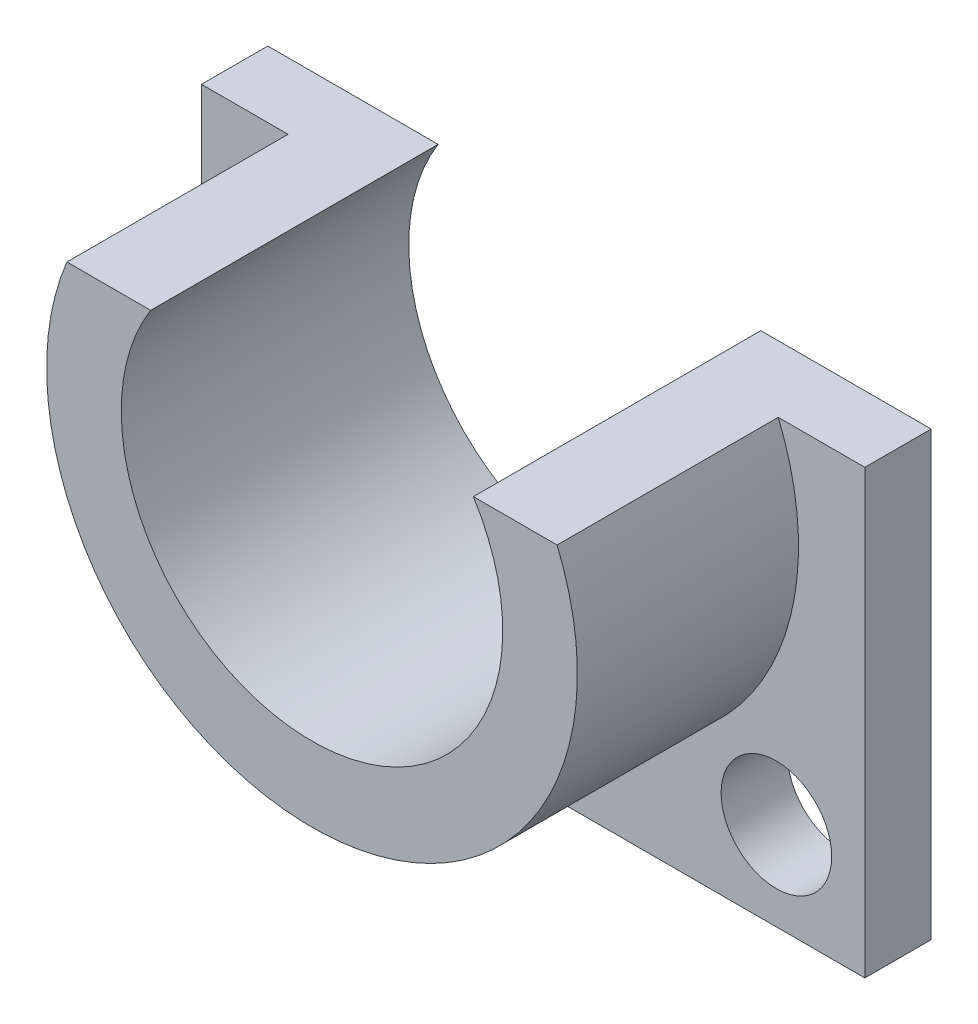
ISO-10303-21;
HEADER;
FILE_DESCRIPTION(('STEP AP214'),'2;1');
FILE_NAME('part.step','',(''),(''),'','','');
FILE_SCHEMA(('AUTOMOTIVE_DESIGN { 1 0 10303 214 1 1 1 1 }'));
ENDSEC;
DATA;
#1=APPLICATION_CONTEXT('core data for automotive mechanical design processes');
#2=APPLICATION_PROTOCOL_DEFINITION('international standard','automotive_design',2000,#1);
#3=PRODUCT_CONTEXT('',#1,'mechanical');
#4=PRODUCT('Part','Part','',(#3));
#5=PRODUCT_RELATED_PRODUCT_CATEGORY('part','',(#4));
#6=PRODUCT_DEFINITION_FORMATION('','',#4);
#7=PRODUCT_DEFINITION_CONTEXT('part definition',#1,'design');
#8=PRODUCT_DEFINITION('design','',#6,#7);
#9=PRODUCT_DEFINITION_SHAPE('','',#8);
#10=(LENGTH_UNIT() NAMED_UNIT(*) SI_UNIT(.MILLI.,.METRE.));
#11=(NAMED_UNIT(*) PLANE_ANGLE_UNIT() SI_UNIT($,.RADIAN.));
#12=(NAMED_UNIT(*) SI_UNIT($,.STERADIAN.) SOLID_ANGLE_UNIT());
#13=UNCERTAINTY_MEASURE_WITH_UNIT(LENGTH_MEASURE(1.E-05),#10,'distance_accuracy_value','');
#14=(GEOMETRIC_REPRESENTATION_CONTEXT(3) GLOBAL_UNCERTAINTY_ASSIGNED_CONTEXT((#13)) GLOBAL_UNIT_ASSIGNED_CONTEXT((#10,
#11,#12)) REPRESENTATION_CONTEXT('',''));
#15=CARTESIAN_POINT('',(0.,0.,0.));
#16=DIRECTION('',(0.,0.,1.));
#17=DIRECTION('',(1.,0.,0.));
#18=AXIS2_PLACEMENT_3D('',#15,#16,#17);
#19=CARTESIAN_POINT('',(9.26583374891318,57.15,3.81));
#20=DIRECTION('',(0.,-1.,0.));
#21=DIRECTION('',(1.,0.,0.));
#22=AXIS2_PLACEMENT_3D('',#19,#20,#21);
#23=PLANE('',#22);
#24=DIRECTION('',(-1.,0.,0.));
#25=VECTOR('',#24,1.);
#26=CARTESIAN_POINT('',(9.26583374891318,57.15,0.));
#27=LINE('',#26,#25);
#28=CARTESIAN_POINT('',(19.05,57.15,0.));
#29=VERTEX_POINT('',#28);
#30=CARTESIAN_POINT('',(9.26583374891324,57.15,0.));
#31=VERTEX_POINT('',#30);
#32=EDGE_CURVE('E145',#29,#31,#27,.T.);
#33=ORIENTED_EDGE('',*,*,#32,.T.);
#34=DIRECTION('',(0.,0.,-1.));
#35=VECTOR('',#34,1.);
#36=CARTESIAN_POINT('',(9.26583374891324,57.15,3.81));
#37=LINE('',#36,#35);
#38=CARTESIAN_POINT('',(9.26583374891324,57.15,16.51));
#39=VERTEX_POINT('',#38);
#40=EDGE_CURVE('E11',#39,#31,#37,.T.);
#41=ORIENTED_EDGE('',*,*,#40,.F.);
#42=DIRECTION('',(-1.,0.,0.));
#43=VECTOR('',#42,1.);
#44=CARTESIAN_POINT('',(14.0758174185373,57.15,16.51));
#45=LINE('',#44,#43);
#46=CARTESIAN_POINT('',(14.0758174185373,57.15,16.51));
#47=VERTEX_POINT('',#46);
#48=EDGE_CURVE('E131',#47,#39,#45,.T.);
#49=ORIENTED_EDGE('',*,*,#48,.F.);
#50=DIRECTION('',(0.,0.,-1.));
#51=VECTOR('',#50,1.);
#52=CARTESIAN_POINT('',(14.0758174185373,57.15,16.51));
#53=LINE('',#52,#51);
#54=CARTESIAN_POINT('',(14.0758174185373,57.15,3.81));
#55=VERTEX_POINT('',#54);
#56=EDGE_CURVE('E140',#47,#55,#53,.T.);
#57=ORIENTED_EDGE('',*,*,#56,.T.);
#58=DIRECTION('',(-1.,0.,0.));
#59=VECTOR('',#58,1.);
#60=CARTESIAN_POINT('',(9.26583374891318,57.15,3.81));
#61=LINE('',#60,#59);
#62=CARTESIAN_POINT('',(19.05,57.15,3.81));
#63=VERTEX_POINT('',#62);
#64=EDGE_CURVE('E146',#63,#55,#61,.T.);
#65=ORIENTED_EDGE('',*,*,#64,.F.);
#66=DIRECTION('',(0.,0.,-1.));
#67=VECTOR('',#66,1.);
#68=CARTESIAN_POINT('',(19.05,57.15,3.81));
#69=LINE('',#68,#67);
#70=EDGE_CURVE('E154',#63,#29,#69,.T.);
#71=ORIENTED_EDGE('',*,*,#70,.T.);
#72=EDGE_LOOP('',(#33,#41,#49,#57,#65,#71));
#73=FACE_BOUND('',#72,.T.);
#74=ADVANCED_FACE('F41',(#73),#23,.F.);
#75=CARTESIAN_POINT('',(0.,51.308,3.81));
#76=DIRECTION('',(0.,0.,-1.));
#77=DIRECTION('',(-1.,0.,0.));
#78=AXIS2_PLACEMENT_3D('',#75,#76,#77);
#79=CYLINDRICAL_SURFACE('',#78,10.9537499999999);
#80=CARTESIAN_POINT('',(0.,51.308,0.));
#81=DIRECTION('',(0.,0.,-1.));
#82=DIRECTION('',(1.,0.,0.));
#83=AXIS2_PLACEMENT_3D('',#80,#81,#82);
#84=CIRCLE('',#83,10.9537499999999);
#85=CARTESIAN_POINT('',(-9.26583374891318,57.15,0.));
#86=VERTEX_POINT('',#85);
#87=EDGE_CURVE('E115',#31,#86,#84,.T.);
#88=ORIENTED_EDGE('',*,*,#87,.T.);
#89=DIRECTION('',(0.,0.,-1.));
#90=VECTOR('',#89,1.);
#91=CARTESIAN_POINT('',(-9.26583374891318,57.15,3.81));
#92=LINE('',#91,#90);
#93=CARTESIAN_POINT('',(-9.26583374891314,57.15,16.51));
#94=VERTEX_POINT('',#93);
#95=EDGE_CURVE('E48',#94,#86,#92,.T.);
#96=ORIENTED_EDGE('',*,*,#95,.F.);
#97=CARTESIAN_POINT('',(0.,51.308,16.51));
#98=DIRECTION('',(0.,0.,-1.));
#99=DIRECTION('',(1.,0.,0.));
#100=AXIS2_PLACEMENT_3D('',#97,#98,#99);
#101=CIRCLE('',#100,10.9537499999999);
#102=EDGE_CURVE('E114',#39,#94,#101,.T.);
#103=ORIENTED_EDGE('',*,*,#102,.F.);
#104=ORIENTED_EDGE('',*,*,#40,.T.);
#105=EDGE_LOOP('',(#88,#96,#103,#104));
#106=FACE_BOUND('',#105,.T.);
#107=ADVANCED_FACE('F112',(#106),#79,.F.);
#108=CARTESIAN_POINT('',(-19.05,57.15,3.81));
#109=DIRECTION('',(0.,-1.,0.));
#110=DIRECTION('',(1.,0.,0.));
#111=AXIS2_PLACEMENT_3D('',#108,#109,#110);
#112=PLANE('',#111);
#113=DIRECTION('',(-1.,0.,0.));
#114=VECTOR('',#113,1.);
#115=CARTESIAN_POINT('',(-19.05,57.15,0.));
#116=LINE('',#115,#114);
#117=CARTESIAN_POINT('',(-19.05,57.15,0.));
#118=VERTEX_POINT('',#117);
#119=EDGE_CURVE('E158',#86,#118,#116,.T.);
#120=ORIENTED_EDGE('',*,*,#119,.T.);
#121=DIRECTION('',(0.,0.,-1.));
#122=VECTOR('',#121,1.);
#123=CARTESIAN_POINT('',(-19.05,57.15,3.81));
#124=LINE('',#123,#122);
#125=CARTESIAN_POINT('',(-19.05,57.15,3.81));
#126=VERTEX_POINT('',#125);
#127=EDGE_CURVE('E118',#126,#118,#124,.T.);
#128=ORIENTED_EDGE('',*,*,#127,.F.);
#129=DIRECTION('',(-1.,0.,0.));
#130=VECTOR('',#129,1.);
#131=CARTESIAN_POINT('',(-19.05,57.15,3.81));
#132=LINE('',#131,#130);
#133=CARTESIAN_POINT('',(-14.0758174185372,57.15,3.81));
#134=VERTEX_POINT('',#133);
#135=EDGE_CURVE('E93',#134,#126,#132,.T.);
#136=ORIENTED_EDGE('',*,*,#135,.F.);
#137=DIRECTION('',(0.,0.,-1.));
#138=VECTOR('',#137,1.);
#139=CARTESIAN_POINT('',(-14.0758174185372,57.1499999999999,16.51));
#140=LINE('',#139,#138);
#141=CARTESIAN_POINT('',(-14.0758174185372,57.1499999999999,16.51));
#142=VERTEX_POINT('',#141);
#143=EDGE_CURVE('E123',#142,#134,#140,.T.);
#144=ORIENTED_EDGE('',*,*,#143,.F.);
#145=DIRECTION('',(-1.,0.,0.));
#146=VECTOR('',#145,1.);
#147=CARTESIAN_POINT('',(-9.26583374891314,57.15,16.51));
#148=LINE('',#147,#146);
#149=EDGE_CURVE('E120',#94,#142,#148,.T.);
#150=ORIENTED_EDGE('',*,*,#149,.F.);
#151=ORIENTED_EDGE('',*,*,#95,.T.);
#152=EDGE_LOOP('',(#120,#128,#136,#144,#150,#151));
#153=FACE_BOUND('',#152,.T.);
#154=ADVANCED_FACE('F121',(#153),#112,.F.);
#155=CARTESIAN_POINT('',(-19.05,31.75,3.81));
#156=DIRECTION('',(1.,0.,0.));
#157=DIRECTION('',(0.,1.,0.));
#158=AXIS2_PLACEMENT_3D('',#155,#156,#157);
#159=PLANE('',#158);
#160=DIRECTION('',(0.,-1.,0.));
#161=VECTOR('',#160,1.);
#162=CARTESIAN_POINT('',(-19.05,31.75,0.));
#163=LINE('',#162,#161);
#164=CARTESIAN_POINT('',(-19.05,31.75,0.));
#165=VERTEX_POINT('',#164);
#166=EDGE_CURVE('E160',#118,#165,#163,.T.);
#167=ORIENTED_EDGE('',*,*,#166,.T.);
#168=DIRECTION('',(0.,0.,-1.));
#169=VECTOR('',#168,1.);
#170=CARTESIAN_POINT('',(-19.05,31.75,3.81));
#171=LINE('',#170,#169);
#172=CARTESIAN_POINT('',(-19.05,31.75,3.81));
#173=VERTEX_POINT('',#172);
#174=EDGE_CURVE('E168',#173,#165,#171,.T.);
#175=ORIENTED_EDGE('',*,*,#174,.F.);
#176=DIRECTION('',(0.,-1.,0.));
#177=VECTOR('',#176,1.);
#178=CARTESIAN_POINT('',(-19.05,31.75,3.81));
#179=LINE('',#178,#177);
#180=EDGE_CURVE('E149',#126,#173,#179,.T.);
#181=ORIENTED_EDGE('',*,*,#180,.F.);
#182=ORIENTED_EDGE('',*,*,#127,.T.);
#183=EDGE_LOOP('',(#167,#175,#181,#182));
#184=FACE_BOUND('',#183,.T.);
#185=ADVANCED_FACE('F175',(#184),#159,.F.);
#186=CARTESIAN_POINT('',(19.05,31.75,3.81));
#187=DIRECTION('',(0.,1.,0.));
#188=DIRECTION('',(0.,0.,1.));
#189=AXIS2_PLACEMENT_3D('',#186,#187,#188);
#190=PLANE('',#189);
#191=DIRECTION('',(1.,0.,0.));
#192=VECTOR('',#191,1.);
#193=CARTESIAN_POINT('',(19.05,31.75,0.));
#194=LINE('',#193,#192);
#195=CARTESIAN_POINT('',(19.05,31.75,0.));
#196=VERTEX_POINT('',#195);
#197=EDGE_CURVE('E162',#165,#196,#194,.T.);
#198=ORIENTED_EDGE('',*,*,#197,.T.);
#199=DIRECTION('',(0.,0.,-1.));
#200=VECTOR('',#199,1.);
#201=CARTESIAN_POINT('',(19.05,31.75,3.81));
#202=LINE('',#201,#200);
#203=CARTESIAN_POINT('',(19.05,31.75,3.81));
#204=VERTEX_POINT('',#203);
#205=EDGE_CURVE('E166',#204,#196,#202,.T.);
#206=ORIENTED_EDGE('',*,*,#205,.F.);
#207=DIRECTION('',(1.,0.,0.));
#208=VECTOR('',#207,1.);
#209=CARTESIAN_POINT('',(19.05,31.75,3.81));
#210=LINE('',#209,#208);
#211=EDGE_CURVE('E151',#173,#204,#210,.T.);
#212=ORIENTED_EDGE('',*,*,#211,.F.);
#213=ORIENTED_EDGE('',*,*,#174,.T.);
#214=EDGE_LOOP('',(#198,#206,#212,#213));
#215=FACE_BOUND('',#214,.T.);
#216=ADVANCED_FACE('F183',(#215),#190,.F.);
#217=CARTESIAN_POINT('',(19.05,57.15,3.81));
#218=DIRECTION('',(-1.,0.,0.));
#219=DIRECTION('',(0.,-1.,0.));
#220=AXIS2_PLACEMENT_3D('',#217,#218,#219);
#221=PLANE('',#220);
#222=DIRECTION('',(0.,1.,0.));
#223=VECTOR('',#222,1.);
#224=CARTESIAN_POINT('',(19.05,57.15,0.));
#225=LINE('',#224,#223);
#226=EDGE_CURVE('E89',#196,#29,#225,.T.);
#227=ORIENTED_EDGE('',*,*,#226,.T.);
#228=ORIENTED_EDGE('',*,*,#70,.F.);
#229=DIRECTION('',(0.,1.,0.));
#230=VECTOR('',#229,1.);
#231=CARTESIAN_POINT('',(19.05,57.15,3.81));
#232=LINE('',#231,#230);
#233=EDGE_CURVE('E62',#204,#63,#232,.T.);
#234=ORIENTED_EDGE('',*,*,#233,.F.);
#235=ORIENTED_EDGE('',*,*,#205,.T.);
#236=EDGE_LOOP('',(#227,#228,#234,#235));
#237=FACE_BOUND('',#236,.T.);
#238=ADVANCED_FACE('F185',(#237),#221,.F.);
#239=CARTESIAN_POINT('',(0.,51.308,3.81));
#240=DIRECTION('',(0.,0.,1.));
#241=DIRECTION('',(1.,0.,0.));
#242=AXIS2_PLACEMENT_3D('',#239,#240,#241);
#243=PLANE('',#242);
#244=CARTESIAN_POINT('',(-13.97,36.83,3.81));
#245=DIRECTION('',(0.,0.,1.));
#246=DIRECTION('',(1.,0.,0.));
#247=AXIS2_PLACEMENT_3D('',#244,#245,#246);
#248=CIRCLE('',#247,3.175);
#249=CARTESIAN_POINT('',(-10.795,36.83,3.81));
#250=VERTEX_POINT('',#249);
#251=EDGE_CURVE('E224',#250,#250,#248,.T.);
#252=ORIENTED_EDGE('',*,*,#251,.F.);
#253=EDGE_LOOP('',(#252));
#254=FACE_BOUND('',#253,.T.);
#255=CARTESIAN_POINT('',(13.97,36.83,3.81));
#256=DIRECTION('',(0.,0.,1.));
#257=DIRECTION('',(-1.,0.,0.));
#258=AXIS2_PLACEMENT_3D('',#255,#256,#257);
#259=CIRCLE('',#258,3.175);
#260=CARTESIAN_POINT('',(10.795,36.83,3.81));
#261=VERTEX_POINT('',#260);
#262=EDGE_CURVE('E136',#261,#261,#259,.T.);
#263=ORIENTED_EDGE('',*,*,#262,.F.);
#264=EDGE_LOOP('',(#263));
#265=FACE_BOUND('',#264,.T.);
#266=CARTESIAN_POINT('',(0.,51.308,3.81));
#267=DIRECTION('',(0.,0.,1.));
#268=DIRECTION('',(-1.,0.,0.));
#269=AXIS2_PLACEMENT_3D('',#266,#267,#268);
#270=CIRCLE('',#269,15.2399999999999);
#271=EDGE_CURVE('E55',#134,#55,#270,.T.);
#272=ORIENTED_EDGE('',*,*,#271,.F.);
#273=ORIENTED_EDGE('',*,*,#135,.T.);
#274=ORIENTED_EDGE('',*,*,#180,.T.);
#275=ORIENTED_EDGE('',*,*,#211,.T.);
#276=ORIENTED_EDGE('',*,*,#233,.T.);
#277=ORIENTED_EDGE('',*,*,#64,.T.);
#278=EDGE_LOOP('',(#272,#273,#274,#275,#276,#277));
#279=FACE_BOUND('',#278,.T.);
#280=ADVANCED_FACE('F189',(#254,#265,#279),#243,.T.);
#281=CARTESIAN_POINT('',(0.,51.308,0.));
#282=DIRECTION('',(0.,0.,1.));
#283=DIRECTION('',(1.,0.,0.));
#284=AXIS2_PLACEMENT_3D('',#281,#282,#283);
#285=PLANE('',#284);
#286=CARTESIAN_POINT('',(-13.97,36.83,0.));
#287=DIRECTION('',(0.,0.,1.));
#288=DIRECTION('',(1.,0.,0.));
#289=AXIS2_PLACEMENT_3D('',#286,#287,#288);
#290=CIRCLE('',#289,3.175);
#291=CARTESIAN_POINT('',(-10.795,36.83,0.));
#292=VERTEX_POINT('',#291);
#293=EDGE_CURVE('E133',#292,#292,#290,.F.);
#294=ORIENTED_EDGE('',*,*,#293,.F.);
#295=EDGE_LOOP('',(#294));
#296=FACE_BOUND('',#295,.T.);
#297=CARTESIAN_POINT('',(13.97,36.83,0.));
#298=DIRECTION('',(0.,0.,1.));
#299=DIRECTION('',(1.,0.,0.));
#300=AXIS2_PLACEMENT_3D('',#297,#298,#299);
#301=CIRCLE('',#300,3.175);
#302=CARTESIAN_POINT('',(17.145,36.83,0.));
#303=VERTEX_POINT('',#302);
#304=EDGE_CURVE('E228',#303,#303,#301,.F.);
#305=ORIENTED_EDGE('',*,*,#304,.F.);
#306=EDGE_LOOP('',(#305));
#307=FACE_BOUND('',#306,.T.);
#308=ORIENTED_EDGE('',*,*,#32,.F.);
#309=ORIENTED_EDGE('',*,*,#226,.F.);
#310=ORIENTED_EDGE('',*,*,#197,.F.);
#311=ORIENTED_EDGE('',*,*,#166,.F.);
#312=ORIENTED_EDGE('',*,*,#119,.F.);
#313=ORIENTED_EDGE('',*,*,#87,.F.);
#314=EDGE_LOOP('',(#308,#309,#310,#311,#312,#313));
#315=FACE_BOUND('',#314,.T.);
#316=ADVANCED_FACE('F180',(#296,#307,#315),#285,.F.);
#317=CARTESIAN_POINT('',(0.,51.308,16.51));
#318=DIRECTION('',(0.,0.,-1.));
#319=DIRECTION('',(-1.,0.,0.));
#320=AXIS2_PLACEMENT_3D('',#317,#318,#319);
#321=CYLINDRICAL_SURFACE('',#320,15.2399999999999);
#322=ORIENTED_EDGE('',*,*,#271,.T.);
#323=ORIENTED_EDGE('',*,*,#56,.F.);
#324=CARTESIAN_POINT('',(0.,51.308,16.51));
#325=DIRECTION('',(0.,0.,1.));
#326=DIRECTION('',(-1.,0.,0.));
#327=AXIS2_PLACEMENT_3D('',#324,#325,#326);
#328=CIRCLE('',#327,15.2399999999999);
#329=EDGE_CURVE('E126',#142,#47,#328,.T.);
#330=ORIENTED_EDGE('',*,*,#329,.F.);
#331=ORIENTED_EDGE('',*,*,#143,.T.);
#332=EDGE_LOOP('',(#322,#323,#330,#331));
#333=FACE_BOUND('',#332,.T.);
#334=ADVANCED_FACE('F191',(#333),#321,.T.);
#335=CARTESIAN_POINT('',(0.,51.308,16.51));
#336=DIRECTION('',(0.,0.,1.));
#337=DIRECTION('',(1.,0.,0.));
#338=AXIS2_PLACEMENT_3D('',#335,#336,#337);
#339=PLANE('',#338);
#340=ORIENTED_EDGE('',*,*,#102,.T.);
#341=ORIENTED_EDGE('',*,*,#149,.T.);
#342=ORIENTED_EDGE('',*,*,#329,.T.);
#343=ORIENTED_EDGE('',*,*,#48,.T.);
#344=EDGE_LOOP('',(#340,#341,#342,#343));
#345=FACE_BOUND('',#344,.T.);
#346=ADVANCED_FACE('F129',(#345),#339,.T.);
#347=CARTESIAN_POINT('',(13.97,36.83,-8.98025612106915));
#348=DIRECTION('',(0.,0.,1.));
#349=DIRECTION('',(1.,0.,0.));
#350=AXIS2_PLACEMENT_3D('',#347,#348,#349);
#351=CYLINDRICAL_SURFACE('',#350,3.175);
#352=ORIENTED_EDGE('',*,*,#304,.T.);
#353=EDGE_LOOP('',(#352));
#354=FACE_BOUND('',#353,.T.);
#355=ORIENTED_EDGE('',*,*,#262,.T.);
#356=EDGE_LOOP('',(#355));
#357=FACE_BOUND('',#356,.T.);
#358=ADVANCED_FACE('F198',(#354,#357),#351,.F.);
#359=CARTESIAN_POINT('',(-13.97,36.83,-8.98025612106915));
#360=DIRECTION('',(0.,0.,1.));
#361=DIRECTION('',(1.,0.,0.));
#362=AXIS2_PLACEMENT_3D('',#359,#360,#361);
#363=CYLINDRICAL_SURFACE('',#362,3.175);
#364=ORIENTED_EDGE('',*,*,#293,.T.);
#365=EDGE_LOOP('',(#364));
#366=FACE_BOUND('',#365,.T.);
#367=ORIENTED_EDGE('',*,*,#251,.T.);
#368=EDGE_LOOP('',(#367));
#369=FACE_BOUND('',#368,.T.);
#370=ADVANCED_FACE('F237',(#366,#369),#363,.F.);
#371=CLOSED_SHELL('',(#74,#107,#154,#185,#216,#238,#280,#316,#334,#346,#358,#370));
#372=MANIFOLD_SOLID_BREP('B2',#371);
#373=ADVANCED_BREP_SHAPE_REPRESENTATION('',(#18,#372),#14);
#374=SHAPE_DEFINITION_REPRESENTATION(#9,#373);
ENDSEC;
END-ISO-10303-21;
